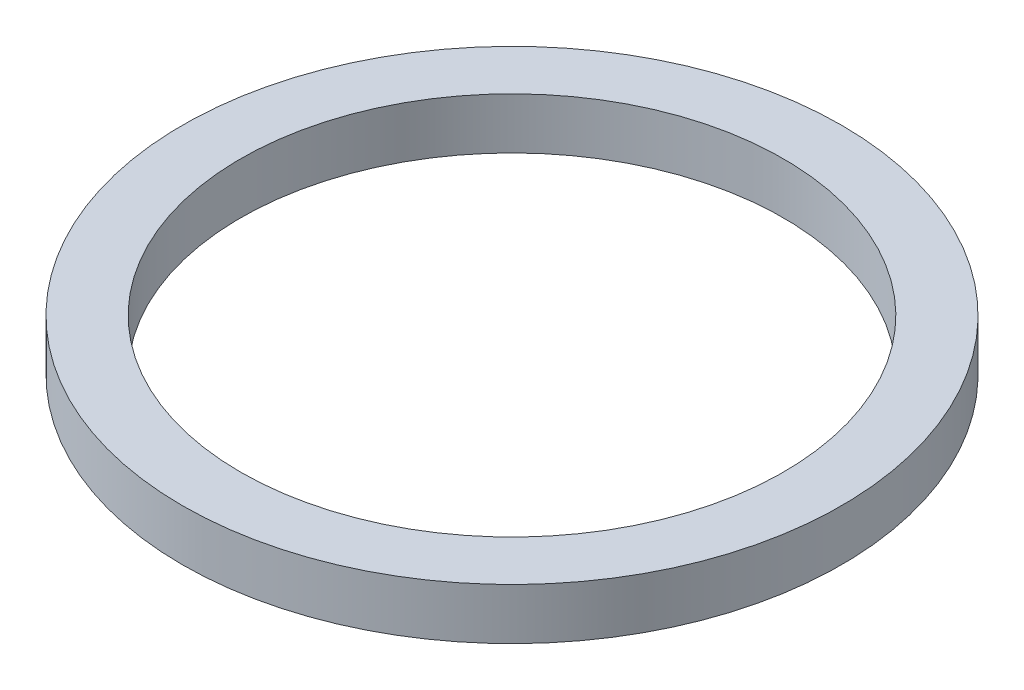
ISO-10303-21;
HEADER;
FILE_DESCRIPTION(('STEP AP214'),'2;1');
FILE_NAME('part.step','',(''),(''),'','','');
FILE_SCHEMA(('AUTOMOTIVE_DESIGN { 1 0 10303 214 1 1 1 1 }'));
ENDSEC;
DATA;
#1=APPLICATION_CONTEXT('core data for automotive mechanical design processes');
#2=APPLICATION_PROTOCOL_DEFINITION('international standard','automotive_design',2000,#1);
#3=PRODUCT_CONTEXT('',#1,'mechanical');
#4=PRODUCT('Part','Part','',(#3));
#5=PRODUCT_RELATED_PRODUCT_CATEGORY('part','',(#4));
#6=PRODUCT_DEFINITION_FORMATION('','',#4);
#7=PRODUCT_DEFINITION_CONTEXT('part definition',#1,'design');
#8=PRODUCT_DEFINITION('design','',#6,#7);
#9=PRODUCT_DEFINITION_SHAPE('','',#8);
#10=(LENGTH_UNIT() NAMED_UNIT(*) SI_UNIT(.MILLI.,.METRE.));
#11=(NAMED_UNIT(*) PLANE_ANGLE_UNIT() SI_UNIT($,.RADIAN.));
#12=(NAMED_UNIT(*) SI_UNIT($,.STERADIAN.) SOLID_ANGLE_UNIT());
#13=UNCERTAINTY_MEASURE_WITH_UNIT(LENGTH_MEASURE(1.E-05),#10,'distance_accuracy_value','');
#14=(GEOMETRIC_REPRESENTATION_CONTEXT(3) GLOBAL_UNCERTAINTY_ASSIGNED_CONTEXT((#13)) GLOBAL_UNIT_ASSIGNED_CONTEXT((#10,
#11,#12)) REPRESENTATION_CONTEXT('',''));
#15=CARTESIAN_POINT('',(0.,0.,0.));
#16=DIRECTION('',(0.,0.,1.));
#17=DIRECTION('',(1.,0.,0.));
#18=AXIS2_PLACEMENT_3D('',#15,#16,#17);
#19=CARTESIAN_POINT('',(0.,3.,0.));
#20=DIRECTION('',(0.,1.,0.));
#21=DIRECTION('',(0.,0.,1.));
#22=AXIS2_PLACEMENT_3D('',#19,#20,#21);
#23=PLANE('',#22);
#24=CARTESIAN_POINT('',(0.,3.,0.));
#25=DIRECTION('',(0.,1.,0.));
#26=DIRECTION('',(0.,0.,1.));
#27=AXIS2_PLACEMENT_3D('',#24,#25,#26);
#28=CIRCLE('',#27,19.305);
#29=CARTESIAN_POINT('',(0.,3.,19.305));
#30=VERTEX_POINT('',#29);
#31=EDGE_CURVE('E10',#30,#30,#28,.T.);
#32=ORIENTED_EDGE('',*,*,#31,.T.);
#33=EDGE_LOOP('',(#32));
#34=FACE_BOUND('',#33,.T.);
#35=CARTESIAN_POINT('',(0.,3.,0.));
#36=DIRECTION('',(0.,1.,0.));
#37=DIRECTION('',(0.,0.,1.));
#38=AXIS2_PLACEMENT_3D('',#35,#36,#37);
#39=CIRCLE('',#38,15.9);
#40=CARTESIAN_POINT('',(0.,3.,15.9));
#41=VERTEX_POINT('',#40);
#42=EDGE_CURVE('E48',#41,#41,#39,.T.);
#43=ORIENTED_EDGE('',*,*,#42,.F.);
#44=EDGE_LOOP('',(#43));
#45=FACE_BOUND('',#44,.T.);
#46=ADVANCED_FACE('F37',(#34,#45),#23,.T.);
#47=CARTESIAN_POINT('',(0.,0.,0.));
#48=DIRECTION('',(0.,1.,0.));
#49=DIRECTION('',(0.,0.,1.));
#50=AXIS2_PLACEMENT_3D('',#47,#48,#49);
#51=PLANE('',#50);
#52=CARTESIAN_POINT('',(0.,0.,0.));
#53=DIRECTION('',(0.,1.,0.));
#54=DIRECTION('',(0.,0.,1.));
#55=AXIS2_PLACEMENT_3D('',#52,#53,#54);
#56=CIRCLE('',#55,19.305);
#57=CARTESIAN_POINT('',(0.,0.,19.305));
#58=VERTEX_POINT('',#57);
#59=EDGE_CURVE('E41',#58,#58,#56,.T.);
#60=ORIENTED_EDGE('',*,*,#59,.F.);
#61=EDGE_LOOP('',(#60));
#62=FACE_BOUND('',#61,.T.);
#63=CARTESIAN_POINT('',(0.,0.,0.));
#64=DIRECTION('',(0.,1.,0.));
#65=DIRECTION('',(0.,0.,1.));
#66=AXIS2_PLACEMENT_3D('',#63,#64,#65);
#67=CIRCLE('',#66,15.9);
#68=CARTESIAN_POINT('',(0.,0.,15.9));
#69=VERTEX_POINT('',#68);
#70=EDGE_CURVE('E50',#69,#69,#67,.T.);
#71=ORIENTED_EDGE('',*,*,#70,.T.);
#72=EDGE_LOOP('',(#71));
#73=FACE_BOUND('',#72,.T.);
#74=ADVANCED_FACE('F60',(#62,#73),#51,.F.);
#75=CARTESIAN_POINT('',(0.,3.,0.));
#76=DIRECTION('',(0.,-1.,0.));
#77=DIRECTION('',(0.,0.,-1.));
#78=AXIS2_PLACEMENT_3D('',#75,#76,#77);
#79=CYLINDRICAL_SURFACE('',#78,19.305);
#80=ORIENTED_EDGE('',*,*,#31,.F.);
#81=EDGE_LOOP('',(#80));
#82=FACE_BOUND('',#81,.T.);
#83=ORIENTED_EDGE('',*,*,#59,.T.);
#84=EDGE_LOOP('',(#83));
#85=FACE_BOUND('',#84,.T.);
#86=ADVANCED_FACE('F39',(#82,#85),#79,.T.);
#87=CARTESIAN_POINT('',(0.,3.,0.));
#88=DIRECTION('',(0.,-1.,0.));
#89=DIRECTION('',(0.,0.,-1.));
#90=AXIS2_PLACEMENT_3D('',#87,#88,#89);
#91=CYLINDRICAL_SURFACE('',#90,15.9);
#92=ORIENTED_EDGE('',*,*,#42,.T.);
#93=EDGE_LOOP('',(#92));
#94=FACE_BOUND('',#93,.T.);
#95=ORIENTED_EDGE('',*,*,#70,.F.);
#96=EDGE_LOOP('',(#95));
#97=FACE_BOUND('',#96,.T.);
#98=ADVANCED_FACE('F56',(#94,#97),#91,.F.);
#99=CLOSED_SHELL('',(#46,#74,#86,#98));
#100=MANIFOLD_SOLID_BREP('B2',#99);
#101=ADVANCED_BREP_SHAPE_REPRESENTATION('',(#18,#100),#14);
#102=SHAPE_DEFINITION_REPRESENTATION(#9,#101);
ENDSEC;
END-ISO-10303-21;
